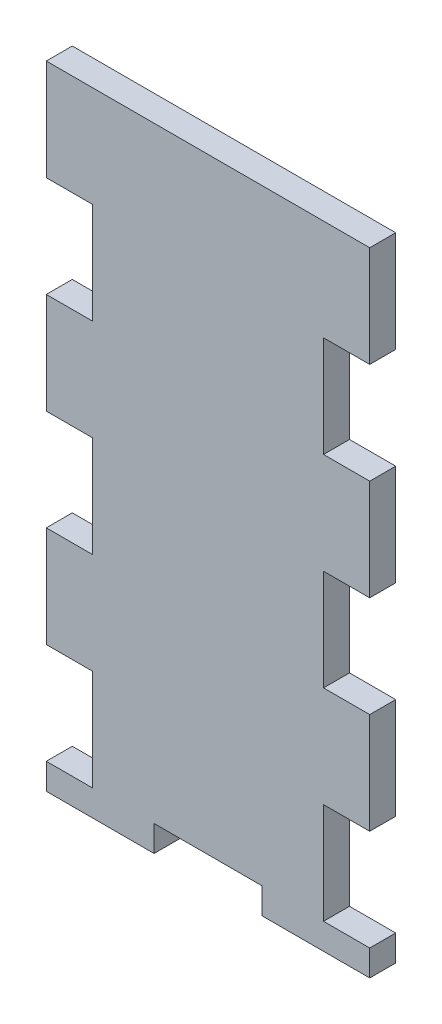
ISO-10303-21;
HEADER;
FILE_DESCRIPTION(('STEP AP214'),'2;1');
FILE_NAME('part.step','',(''),(''),'','','');
FILE_SCHEMA(('AUTOMOTIVE_DESIGN { 1 0 10303 214 1 1 1 1 }'));
ENDSEC;
DATA;
#1=APPLICATION_CONTEXT('core data for automotive mechanical design processes');
#2=APPLICATION_PROTOCOL_DEFINITION('international standard','automotive_design',2000,#1);
#3=PRODUCT_CONTEXT('',#1,'mechanical');
#4=PRODUCT('Part','Part','',(#3));
#5=PRODUCT_RELATED_PRODUCT_CATEGORY('part','',(#4));
#6=PRODUCT_DEFINITION_FORMATION('','',#4);
#7=PRODUCT_DEFINITION_CONTEXT('part definition',#1,'design');
#8=PRODUCT_DEFINITION('design','',#6,#7);
#9=PRODUCT_DEFINITION_SHAPE('','',#8);
#10=(LENGTH_UNIT() NAMED_UNIT(*) SI_UNIT(.MILLI.,.METRE.));
#11=(NAMED_UNIT(*) PLANE_ANGLE_UNIT() SI_UNIT($,.RADIAN.));
#12=(NAMED_UNIT(*) SI_UNIT($,.STERADIAN.) SOLID_ANGLE_UNIT());
#13=UNCERTAINTY_MEASURE_WITH_UNIT(LENGTH_MEASURE(1.E-05),#10,'distance_accuracy_value','');
#14=(GEOMETRIC_REPRESENTATION_CONTEXT(3) GLOBAL_UNCERTAINTY_ASSIGNED_CONTEXT((#13)) GLOBAL_UNIT_ASSIGNED_CONTEXT((#10,
#11,#12)) REPRESENTATION_CONTEXT('',''));
#15=CARTESIAN_POINT('',(0.,0.,0.));
#16=DIRECTION('',(0.,0.,1.));
#17=DIRECTION('',(1.,0.,0.));
#18=AXIS2_PLACEMENT_3D('',#15,#16,#17);
#19=CARTESIAN_POINT('',(-4.,-2.25,30.3402563178053));
#20=DIRECTION('',(0.,-1.,0.));
#21=DIRECTION('',(1.,0.,0.));
#22=AXIS2_PLACEMENT_3D('',#19,#20,#21);
#23=PLANE('',#22);
#24=DIRECTION('',(0.,0.,1.));
#25=VECTOR('',#24,1.);
#26=CARTESIAN_POINT('',(14.6666666666667,-2.25,0.));
#27=LINE('',#26,#25);
#28=CARTESIAN_POINT('',(14.6666666666667,-2.25,0.));
#29=VERTEX_POINT('',#28);
#30=CARTESIAN_POINT('',(14.6666666666667,-2.25,2.25));
#31=VERTEX_POINT('',#30);
#32=EDGE_CURVE('E476',#29,#31,#27,.T.);
#33=ORIENTED_EDGE('',*,*,#32,.F.);
#34=DIRECTION('',(-1.,0.,0.));
#35=VECTOR('',#34,1.);
#36=CARTESIAN_POINT('',(-4.,-2.25,0.));
#37=LINE('',#36,#35);
#38=CARTESIAN_POINT('',(24.,-2.25,0.));
#39=VERTEX_POINT('',#38);
#40=EDGE_CURVE('E1016',#39,#29,#37,.T.);
#41=ORIENTED_EDGE('',*,*,#40,.F.);
#42=DIRECTION('',(0.,0.,-1.));
#43=VECTOR('',#42,1.);
#44=CARTESIAN_POINT('',(24.,-2.25,30.3402563178053));
#45=LINE('',#44,#43);
#46=CARTESIAN_POINT('',(24.,-2.25,2.25));
#47=VERTEX_POINT('',#46);
#48=EDGE_CURVE('E486',#47,#39,#45,.T.);
#49=ORIENTED_EDGE('',*,*,#48,.F.);
#50=DIRECTION('',(-1.,0.,0.));
#51=VECTOR('',#50,1.);
#52=CARTESIAN_POINT('',(-4.,-2.25,2.25));
#53=LINE('',#52,#51);
#54=EDGE_CURVE('E485',#47,#31,#53,.T.);
#55=ORIENTED_EDGE('',*,*,#54,.T.);
#56=EDGE_LOOP('',(#33,#41,#49,#55));
#57=FACE_BOUND('',#56,.T.);
#58=ADVANCED_FACE('F39',(#57),#23,.T.);
#59=CARTESIAN_POINT('',(20.,0.,2.25));
#60=DIRECTION('',(-1.,0.,0.));
#61=DIRECTION('',(0.,0.,1.));
#62=AXIS2_PLACEMENT_3D('',#59,#60,#61);
#63=PLANE('',#62);
#64=DIRECTION('',(0.,1.,0.));
#65=VECTOR('',#64,1.);
#66=CARTESIAN_POINT('',(20.,0.,0.));
#67=LINE('',#66,#65);
#68=CARTESIAN_POINT('',(20.,0.,0.));
#69=VERTEX_POINT('',#68);
#70=CARTESIAN_POINT('',(20.,8.75000000000001,0.));
#71=VERTEX_POINT('',#70);
#72=EDGE_CURVE('E242',#69,#71,#67,.T.);
#73=ORIENTED_EDGE('',*,*,#72,.T.);
#74=DIRECTION('',(0.,0.,-1.));
#75=VECTOR('',#74,1.);
#76=CARTESIAN_POINT('',(20.,8.75000000000001,2.25));
#77=LINE('',#76,#75);
#78=CARTESIAN_POINT('',(20.,8.75000000000001,2.25));
#79=VERTEX_POINT('',#78);
#80=EDGE_CURVE('E47',#79,#71,#77,.T.);
#81=ORIENTED_EDGE('',*,*,#80,.F.);
#82=DIRECTION('',(0.,1.,0.));
#83=VECTOR('',#82,1.);
#84=CARTESIAN_POINT('',(20.,0.,2.25));
#85=LINE('',#84,#83);
#86=CARTESIAN_POINT('',(20.,0.,2.25));
#87=VERTEX_POINT('',#86);
#88=EDGE_CURVE('E147',#87,#79,#85,.T.);
#89=ORIENTED_EDGE('',*,*,#88,.F.);
#90=DIRECTION('',(0.,0.,-1.));
#91=VECTOR('',#90,1.);
#92=CARTESIAN_POINT('',(20.,0.,2.25));
#93=LINE('',#92,#91);
#94=EDGE_CURVE('E11',#87,#69,#93,.T.);
#95=ORIENTED_EDGE('',*,*,#94,.T.);
#96=EDGE_LOOP('',(#73,#81,#89,#95));
#97=FACE_BOUND('',#96,.T.);
#98=ADVANCED_FACE('F438',(#97),#63,.F.);
#99=CARTESIAN_POINT('',(-2.73218947466328E-13,8.74999999999939,2.25));
#100=DIRECTION('',(0.,1.,0.));
#101=DIRECTION('',(-1.,0.,0.));
#102=AXIS2_PLACEMENT_3D('',#99,#100,#101);
#103=PLANE('',#102);
#104=DIRECTION('',(1.,0.,0.));
#105=VECTOR('',#104,1.);
#106=CARTESIAN_POINT('',(-2.73218947466328E-13,8.74999999999939,0.));
#107=LINE('',#106,#105);
#108=CARTESIAN_POINT('',(24.,8.75000000000014,0.));
#109=VERTEX_POINT('',#108);
#110=EDGE_CURVE('E244',#71,#109,#107,.T.);
#111=ORIENTED_EDGE('',*,*,#110,.T.);
#112=DIRECTION('',(0.,0.,-1.));
#113=VECTOR('',#112,1.);
#114=CARTESIAN_POINT('',(24.,8.75000000000014,2.25));
#115=LINE('',#114,#113);
#116=CARTESIAN_POINT('',(24.,8.75000000000014,2.25));
#117=VERTEX_POINT('',#116);
#118=EDGE_CURVE('E339',#117,#109,#115,.T.);
#119=ORIENTED_EDGE('',*,*,#118,.F.);
#120=DIRECTION('',(1.,0.,0.));
#121=VECTOR('',#120,1.);
#122=CARTESIAN_POINT('',(-2.73218947466328E-13,8.74999999999939,2.25));
#123=LINE('',#122,#121);
#124=EDGE_CURVE('E345',#79,#117,#123,.T.);
#125=ORIENTED_EDGE('',*,*,#124,.F.);
#126=ORIENTED_EDGE('',*,*,#80,.T.);
#127=EDGE_LOOP('',(#111,#119,#125,#126));
#128=FACE_BOUND('',#127,.T.);
#129=ADVANCED_FACE('F41',(#128),#103,.F.);
#130=CARTESIAN_POINT('',(24.,0.,2.25));
#131=DIRECTION('',(1.,0.,0.));
#132=DIRECTION('',(0.,0.,-1.));
#133=AXIS2_PLACEMENT_3D('',#130,#131,#132);
#134=PLANE('',#133);
#135=DIRECTION('',(0.,-1.,0.));
#136=VECTOR('',#135,1.);
#137=CARTESIAN_POINT('',(24.,0.,0.));
#138=LINE('',#137,#136);
#139=CARTESIAN_POINT('',(24.,17.5,0.));
#140=VERTEX_POINT('',#139);
#141=EDGE_CURVE('E250',#140,#109,#138,.T.);
#142=ORIENTED_EDGE('',*,*,#141,.F.);
#143=DIRECTION('',(0.,0.,-1.));
#144=VECTOR('',#143,1.);
#145=CARTESIAN_POINT('',(24.,17.5,2.25));
#146=LINE('',#145,#144);
#147=CARTESIAN_POINT('',(24.,17.5,2.25));
#148=VERTEX_POINT('',#147);
#149=EDGE_CURVE('E337',#148,#140,#146,.T.);
#150=ORIENTED_EDGE('',*,*,#149,.F.);
#151=DIRECTION('',(0.,-1.,0.));
#152=VECTOR('',#151,1.);
#153=CARTESIAN_POINT('',(24.,0.,2.25));
#154=LINE('',#153,#152);
#155=EDGE_CURVE('E356',#148,#117,#154,.T.);
#156=ORIENTED_EDGE('',*,*,#155,.T.);
#157=ORIENTED_EDGE('',*,*,#118,.T.);
#158=EDGE_LOOP('',(#142,#150,#156,#157));
#159=FACE_BOUND('',#158,.T.);
#160=ADVANCED_FACE('F353',(#159),#134,.T.);
#161=CARTESIAN_POINT('',(0.,17.5000000000001,2.25));
#162=DIRECTION('',(0.,1.,0.));
#163=DIRECTION('',(-1.,0.,0.));
#164=AXIS2_PLACEMENT_3D('',#161,#162,#163);
#165=PLANE('',#164);
#166=DIRECTION('',(1.,0.,0.));
#167=VECTOR('',#166,1.);
#168=CARTESIAN_POINT('',(0.,17.5000000000001,0.));
#169=LINE('',#168,#167);
#170=CARTESIAN_POINT('',(20.,17.5,0.));
#171=VERTEX_POINT('',#170);
#172=EDGE_CURVE('E253',#171,#140,#169,.T.);
#173=ORIENTED_EDGE('',*,*,#172,.F.);
#174=DIRECTION('',(0.,0.,-1.));
#175=VECTOR('',#174,1.);
#176=CARTESIAN_POINT('',(20.,17.5,2.25));
#177=LINE('',#176,#175);
#178=CARTESIAN_POINT('',(20.,17.5,2.25));
#179=VERTEX_POINT('',#178);
#180=EDGE_CURVE('E335',#179,#171,#177,.T.);
#181=ORIENTED_EDGE('',*,*,#180,.F.);
#182=DIRECTION('',(1.,0.,0.));
#183=VECTOR('',#182,1.);
#184=CARTESIAN_POINT('',(0.,17.5000000000001,2.25));
#185=LINE('',#184,#183);
#186=EDGE_CURVE('E359',#179,#148,#185,.T.);
#187=ORIENTED_EDGE('',*,*,#186,.T.);
#188=ORIENTED_EDGE('',*,*,#149,.T.);
#189=EDGE_LOOP('',(#173,#181,#187,#188));
#190=FACE_BOUND('',#189,.T.);
#191=ADVANCED_FACE('F540',(#190),#165,.T.);
#192=CARTESIAN_POINT('',(20.,26.2500000000001,0.));
#193=VERTEX_POINT('',#192);
#194=EDGE_CURVE('E247',#171,#193,#67,.T.);
#195=ORIENTED_EDGE('',*,*,#194,.T.);
#196=DIRECTION('',(0.,0.,-1.));
#197=VECTOR('',#196,1.);
#198=CARTESIAN_POINT('',(20.,26.2500000000001,2.25));
#199=LINE('',#198,#197);
#200=CARTESIAN_POINT('',(20.,26.2500000000001,2.25));
#201=VERTEX_POINT('',#200);
#202=EDGE_CURVE('E332',#201,#193,#199,.T.);
#203=ORIENTED_EDGE('',*,*,#202,.F.);
#204=EDGE_CURVE('E361',#179,#201,#85,.T.);
#205=ORIENTED_EDGE('',*,*,#204,.F.);
#206=ORIENTED_EDGE('',*,*,#180,.T.);
#207=EDGE_LOOP('',(#195,#203,#205,#206));
#208=FACE_BOUND('',#207,.T.);
#209=ADVANCED_FACE('F446',(#208),#63,.F.);
#210=CARTESIAN_POINT('',(0.,26.2500000000001,2.25));
#211=DIRECTION('',(0.,1.,0.));
#212=DIRECTION('',(0.,0.,1.));
#213=AXIS2_PLACEMENT_3D('',#210,#211,#212);
#214=PLANE('',#213);
#215=DIRECTION('',(1.,0.,0.));
#216=VECTOR('',#215,1.);
#217=CARTESIAN_POINT('',(0.,26.2500000000001,0.));
#218=LINE('',#217,#216);
#219=CARTESIAN_POINT('',(24.,26.2500000000001,0.));
#220=VERTEX_POINT('',#219);
#221=EDGE_CURVE('E256',#193,#220,#218,.T.);
#222=ORIENTED_EDGE('',*,*,#221,.T.);
#223=DIRECTION('',(0.,0.,-1.));
#224=VECTOR('',#223,1.);
#225=CARTESIAN_POINT('',(24.,26.2500000000001,2.25));
#226=LINE('',#225,#224);
#227=CARTESIAN_POINT('',(24.,26.2500000000001,2.25));
#228=VERTEX_POINT('',#227);
#229=EDGE_CURVE('E330',#228,#220,#226,.T.);
#230=ORIENTED_EDGE('',*,*,#229,.F.);
#231=DIRECTION('',(1.,0.,0.));
#232=VECTOR('',#231,1.);
#233=CARTESIAN_POINT('',(0.,26.2500000000001,2.25));
#234=LINE('',#233,#232);
#235=EDGE_CURVE('E366',#201,#228,#234,.T.);
#236=ORIENTED_EDGE('',*,*,#235,.F.);
#237=ORIENTED_EDGE('',*,*,#202,.T.);
#238=EDGE_LOOP('',(#222,#230,#236,#237));
#239=FACE_BOUND('',#238,.T.);
#240=ADVANCED_FACE('F513',(#239),#214,.F.);
#241=CARTESIAN_POINT('',(24.,0.,2.25));
#242=DIRECTION('',(1.,0.,0.));
#243=DIRECTION('',(0.,0.,-1.));
#244=AXIS2_PLACEMENT_3D('',#241,#242,#243);
#245=PLANE('',#244);
#246=DIRECTION('',(0.,-1.,0.));
#247=VECTOR('',#246,1.);
#248=CARTESIAN_POINT('',(24.,0.,0.));
#249=LINE('',#248,#247);
#250=CARTESIAN_POINT('',(24.,35.,0.));
#251=VERTEX_POINT('',#250);
#252=EDGE_CURVE('E259',#251,#220,#249,.T.);
#253=ORIENTED_EDGE('',*,*,#252,.F.);
#254=DIRECTION('',(0.,0.,-1.));
#255=VECTOR('',#254,1.);
#256=CARTESIAN_POINT('',(24.,35.,2.25));
#257=LINE('',#256,#255);
#258=CARTESIAN_POINT('',(24.,35.,2.25));
#259=VERTEX_POINT('',#258);
#260=EDGE_CURVE('E328',#259,#251,#257,.T.);
#261=ORIENTED_EDGE('',*,*,#260,.F.);
#262=DIRECTION('',(0.,-1.,0.));
#263=VECTOR('',#262,1.);
#264=CARTESIAN_POINT('',(24.,0.,2.25));
#265=LINE('',#264,#263);
#266=EDGE_CURVE('E368',#259,#228,#265,.T.);
#267=ORIENTED_EDGE('',*,*,#266,.T.);
#268=ORIENTED_EDGE('',*,*,#229,.T.);
#269=EDGE_LOOP('',(#253,#261,#267,#268));
#270=FACE_BOUND('',#269,.T.);
#271=ADVANCED_FACE('F516',(#270),#245,.T.);
#272=CARTESIAN_POINT('',(3.64291929955066E-13,35.0000000000003,2.25));
#273=DIRECTION('',(0.,1.,0.));
#274=DIRECTION('',(-1.,0.,0.));
#275=AXIS2_PLACEMENT_3D('',#272,#273,#274);
#276=PLANE('',#275);
#277=DIRECTION('',(1.,0.,0.));
#278=VECTOR('',#277,1.);
#279=CARTESIAN_POINT('',(3.64291929955066E-13,35.0000000000003,0.));
#280=LINE('',#279,#278);
#281=CARTESIAN_POINT('',(20.,35.0000000000001,0.));
#282=VERTEX_POINT('',#281);
#283=EDGE_CURVE('E262',#282,#251,#280,.T.);
#284=ORIENTED_EDGE('',*,*,#283,.F.);
#285=DIRECTION('',(0.,0.,-1.));
#286=VECTOR('',#285,1.);
#287=CARTESIAN_POINT('',(20.,35.0000000000001,2.25));
#288=LINE('',#287,#286);
#289=CARTESIAN_POINT('',(20.,35.0000000000001,2.25));
#290=VERTEX_POINT('',#289);
#291=EDGE_CURVE('E326',#290,#282,#288,.T.);
#292=ORIENTED_EDGE('',*,*,#291,.F.);
#293=DIRECTION('',(1.,0.,0.));
#294=VECTOR('',#293,1.);
#295=CARTESIAN_POINT('',(3.64291929955066E-13,35.0000000000003,2.25));
#296=LINE('',#295,#294);
#297=EDGE_CURVE('E371',#290,#259,#296,.T.);
#298=ORIENTED_EDGE('',*,*,#297,.T.);
#299=ORIENTED_EDGE('',*,*,#260,.T.);
#300=EDGE_LOOP('',(#284,#292,#298,#299));
#301=FACE_BOUND('',#300,.T.);
#302=ADVANCED_FACE('F520',(#301),#276,.T.);
#303=CARTESIAN_POINT('',(20.,43.75,0.));
#304=VERTEX_POINT('',#303);
#305=EDGE_CURVE('E246',#282,#304,#67,.T.);
#306=ORIENTED_EDGE('',*,*,#305,.T.);
#307=DIRECTION('',(0.,0.,-1.));
#308=VECTOR('',#307,1.);
#309=CARTESIAN_POINT('',(20.,43.75,2.25));
#310=LINE('',#309,#308);
#311=CARTESIAN_POINT('',(20.,43.75,2.25));
#312=VERTEX_POINT('',#311);
#313=EDGE_CURVE('E323',#312,#304,#310,.T.);
#314=ORIENTED_EDGE('',*,*,#313,.F.);
#315=EDGE_CURVE('E374',#290,#312,#85,.T.);
#316=ORIENTED_EDGE('',*,*,#315,.F.);
#317=ORIENTED_EDGE('',*,*,#291,.T.);
#318=EDGE_LOOP('',(#306,#314,#316,#317));
#319=FACE_BOUND('',#318,.T.);
#320=ADVANCED_FACE('F447',(#319),#63,.F.);
#321=CARTESIAN_POINT('',(-4.5536491244391E-13,43.7499999999998,2.25));
#322=DIRECTION('',(0.,1.,0.));
#323=DIRECTION('',(-1.,0.,0.));
#324=AXIS2_PLACEMENT_3D('',#321,#322,#323);
#325=PLANE('',#324);
#326=DIRECTION('',(1.,0.,0.));
#327=VECTOR('',#326,1.);
#328=CARTESIAN_POINT('',(-4.5536491244391E-13,43.7499999999998,0.));
#329=LINE('',#328,#327);
#330=CARTESIAN_POINT('',(24.,43.75,0.));
#331=VERTEX_POINT('',#330);
#332=EDGE_CURVE('E265',#304,#331,#329,.T.);
#333=ORIENTED_EDGE('',*,*,#332,.T.);
#334=DIRECTION('',(0.,0.,-1.));
#335=VECTOR('',#334,1.);
#336=CARTESIAN_POINT('',(24.,43.75,2.25));
#337=LINE('',#336,#335);
#338=CARTESIAN_POINT('',(24.,43.75,2.25));
#339=VERTEX_POINT('',#338);
#340=EDGE_CURVE('E321',#339,#331,#337,.T.);
#341=ORIENTED_EDGE('',*,*,#340,.F.);
#342=DIRECTION('',(1.,0.,0.));
#343=VECTOR('',#342,1.);
#344=CARTESIAN_POINT('',(-4.5536491244391E-13,43.7499999999998,2.25));
#345=LINE('',#344,#343);
#346=EDGE_CURVE('E375',#312,#339,#345,.T.);
#347=ORIENTED_EDGE('',*,*,#346,.F.);
#348=ORIENTED_EDGE('',*,*,#313,.T.);
#349=EDGE_LOOP('',(#333,#341,#347,#348));
#350=FACE_BOUND('',#349,.T.);
#351=ADVANCED_FACE('F529',(#350),#325,.F.);
#352=CARTESIAN_POINT('',(24.,0.,2.25));
#353=DIRECTION('',(1.,0.,0.));
#354=DIRECTION('',(0.,0.,-1.));
#355=AXIS2_PLACEMENT_3D('',#352,#353,#354);
#356=PLANE('',#355);
#357=DIRECTION('',(0.,-1.,0.));
#358=VECTOR('',#357,1.);
#359=CARTESIAN_POINT('',(24.,0.,0.));
#360=LINE('',#359,#358);
#361=CARTESIAN_POINT('',(24.,52.5,0.));
#362=VERTEX_POINT('',#361);
#363=EDGE_CURVE('E268',#362,#331,#360,.T.);
#364=ORIENTED_EDGE('',*,*,#363,.F.);
#365=DIRECTION('',(0.,0.,-1.));
#366=VECTOR('',#365,1.);
#367=CARTESIAN_POINT('',(24.,52.5,2.25));
#368=LINE('',#367,#366);
#369=CARTESIAN_POINT('',(24.,52.5,2.25));
#370=VERTEX_POINT('',#369);
#371=EDGE_CURVE('E318',#370,#362,#368,.T.);
#372=ORIENTED_EDGE('',*,*,#371,.F.);
#373=DIRECTION('',(0.,-1.,0.));
#374=VECTOR('',#373,1.);
#375=CARTESIAN_POINT('',(24.,0.,2.25));
#376=LINE('',#375,#374);
#377=EDGE_CURVE('E377',#370,#339,#376,.T.);
#378=ORIENTED_EDGE('',*,*,#377,.T.);
#379=ORIENTED_EDGE('',*,*,#340,.T.);
#380=EDGE_LOOP('',(#364,#372,#378,#379));
#381=FACE_BOUND('',#380,.T.);
#382=ADVANCED_FACE('F533',(#381),#356,.T.);
#383=CARTESIAN_POINT('',(1.3660947373318E-12,52.4999999999999,2.25));
#384=DIRECTION('',(0.,-1.,0.));
#385=DIRECTION('',(1.,0.,0.));
#386=AXIS2_PLACEMENT_3D('',#383,#384,#385);
#387=PLANE('',#386);
#388=DIRECTION('',(-1.,0.,0.));
#389=VECTOR('',#388,1.);
#390=CARTESIAN_POINT('',(1.3660947373318E-12,52.4999999999999,0.));
#391=LINE('',#390,#389);
#392=CARTESIAN_POINT('',(-4.,52.5,0.));
#393=VERTEX_POINT('',#392);
#394=EDGE_CURVE('E271',#362,#393,#391,.T.);
#395=ORIENTED_EDGE('',*,*,#394,.T.);
#396=DIRECTION('',(0.,0.,-1.));
#397=VECTOR('',#396,1.);
#398=CARTESIAN_POINT('',(-4.,52.5,2.25));
#399=LINE('',#398,#397);
#400=CARTESIAN_POINT('',(-4.,52.5,2.25));
#401=VERTEX_POINT('',#400);
#402=EDGE_CURVE('E315',#401,#393,#399,.T.);
#403=ORIENTED_EDGE('',*,*,#402,.F.);
#404=DIRECTION('',(1.,0.,0.));
#405=VECTOR('',#404,1.);
#406=CARTESIAN_POINT('',(0.,52.5,2.25));
#407=LINE('',#406,#405);
#408=EDGE_CURVE('E380',#401,#370,#407,.T.);
#409=ORIENTED_EDGE('',*,*,#408,.T.);
#410=ORIENTED_EDGE('',*,*,#371,.T.);
#411=EDGE_LOOP('',(#395,#403,#409,#410));
#412=FACE_BOUND('',#411,.T.);
#413=ADVANCED_FACE('F535',(#412),#387,.F.);
#414=CARTESIAN_POINT('',(-4.,0.,2.25));
#415=DIRECTION('',(1.,0.,0.));
#416=DIRECTION('',(0.,0.,-1.));
#417=AXIS2_PLACEMENT_3D('',#414,#415,#416);
#418=PLANE('',#417);
#419=DIRECTION('',(0.,-1.,0.));
#420=VECTOR('',#419,1.);
#421=CARTESIAN_POINT('',(-4.,0.,0.));
#422=LINE('',#421,#420);
#423=CARTESIAN_POINT('',(-4.,43.75,0.));
#424=VERTEX_POINT('',#423);
#425=EDGE_CURVE('E279',#393,#424,#422,.T.);
#426=ORIENTED_EDGE('',*,*,#425,.T.);
#427=DIRECTION('',(0.,0.,-1.));
#428=VECTOR('',#427,1.);
#429=CARTESIAN_POINT('',(-4.,43.75,2.25));
#430=LINE('',#429,#428);
#431=CARTESIAN_POINT('',(-4.,43.75,2.25));
#432=VERTEX_POINT('',#431);
#433=EDGE_CURVE('E313',#432,#424,#430,.T.);
#434=ORIENTED_EDGE('',*,*,#433,.F.);
#435=DIRECTION('',(0.,-1.,0.));
#436=VECTOR('',#435,1.);
#437=CARTESIAN_POINT('',(-4.,0.,2.25));
#438=LINE('',#437,#436);
#439=EDGE_CURVE('E382',#401,#432,#438,.T.);
#440=ORIENTED_EDGE('',*,*,#439,.F.);
#441=ORIENTED_EDGE('',*,*,#402,.T.);
#442=EDGE_LOOP('',(#426,#434,#440,#441));
#443=FACE_BOUND('',#442,.T.);
#444=ADVANCED_FACE('F538',(#443),#418,.F.);
#445=CARTESIAN_POINT('',(1.13841228110978E-12,43.75,2.25));
#446=DIRECTION('',(0.,-1.,0.));
#447=DIRECTION('',(1.,0.,0.));
#448=AXIS2_PLACEMENT_3D('',#445,#446,#447);
#449=PLANE('',#448);
#450=DIRECTION('',(-1.,0.,0.));
#451=VECTOR('',#450,1.);
#452=CARTESIAN_POINT('',(1.13841228110978E-12,43.75,0.));
#453=LINE('',#452,#451);
#454=CARTESIAN_POINT('',(0.,43.75,0.));
#455=VERTEX_POINT('',#454);
#456=EDGE_CURVE('E282',#455,#424,#453,.T.);
#457=ORIENTED_EDGE('',*,*,#456,.F.);
#458=DIRECTION('',(0.,0.,-1.));
#459=VECTOR('',#458,1.);
#460=CARTESIAN_POINT('',(0.,43.75,2.25));
#461=LINE('',#460,#459);
#462=CARTESIAN_POINT('',(0.,43.75,2.25));
#463=VERTEX_POINT('',#462);
#464=EDGE_CURVE('E311',#463,#455,#461,.T.);
#465=ORIENTED_EDGE('',*,*,#464,.F.);
#466=DIRECTION('',(-1.,0.,0.));
#467=VECTOR('',#466,1.);
#468=CARTESIAN_POINT('',(1.13841228110978E-12,43.75,2.25));
#469=LINE('',#468,#467);
#470=EDGE_CURVE('E385',#463,#432,#469,.T.);
#471=ORIENTED_EDGE('',*,*,#470,.T.);
#472=ORIENTED_EDGE('',*,*,#433,.T.);
#473=EDGE_LOOP('',(#457,#465,#471,#472));
#474=FACE_BOUND('',#473,.T.);
#475=ADVANCED_FACE('F408',(#474),#449,.T.);
#476=CARTESIAN_POINT('',(0.,0.,2.25));
#477=DIRECTION('',(-1.,0.,0.));
#478=DIRECTION('',(0.,0.,1.));
#479=AXIS2_PLACEMENT_3D('',#476,#477,#478);
#480=PLANE('',#479);
#481=DIRECTION('',(0.,1.,0.));
#482=VECTOR('',#481,1.);
#483=CARTESIAN_POINT('',(0.,0.,0.));
#484=LINE('',#483,#482);
#485=CARTESIAN_POINT('',(0.,34.9999999999999,0.));
#486=VERTEX_POINT('',#485);
#487=EDGE_CURVE('E277',#486,#455,#484,.T.);
#488=ORIENTED_EDGE('',*,*,#487,.F.);
#489=DIRECTION('',(0.,0.,-1.));
#490=VECTOR('',#489,1.);
#491=CARTESIAN_POINT('',(0.,34.9999999999999,2.25));
#492=LINE('',#491,#490);
#493=CARTESIAN_POINT('',(0.,34.9999999999999,2.25));
#494=VERTEX_POINT('',#493);
#495=EDGE_CURVE('E309',#494,#486,#492,.T.);
#496=ORIENTED_EDGE('',*,*,#495,.F.);
#497=DIRECTION('',(0.,1.,0.));
#498=VECTOR('',#497,1.);
#499=CARTESIAN_POINT('',(0.,0.,2.25));
#500=LINE('',#499,#498);
#501=EDGE_CURVE('E239',#494,#463,#500,.T.);
#502=ORIENTED_EDGE('',*,*,#501,.T.);
#503=ORIENTED_EDGE('',*,*,#464,.T.);
#504=EDGE_LOOP('',(#488,#496,#502,#503));
#505=FACE_BOUND('',#504,.T.);
#506=ADVANCED_FACE('F400',(#505),#480,.T.);
#507=CARTESIAN_POINT('',(1.45716771982051E-12,34.9999999999999,2.25));
#508=DIRECTION('',(0.,-1.,0.));
#509=DIRECTION('',(1.,0.,0.));
#510=AXIS2_PLACEMENT_3D('',#507,#508,#509);
#511=PLANE('',#510);
#512=DIRECTION('',(-1.,0.,0.));
#513=VECTOR('',#512,1.);
#514=CARTESIAN_POINT('',(1.45716771982051E-12,34.9999999999999,0.));
#515=LINE('',#514,#513);
#516=CARTESIAN_POINT('',(-4.,35.,0.));
#517=VERTEX_POINT('',#516);
#518=EDGE_CURVE('E285',#486,#517,#515,.T.);
#519=ORIENTED_EDGE('',*,*,#518,.T.);
#520=DIRECTION('',(0.,0.,-1.));
#521=VECTOR('',#520,1.);
#522=CARTESIAN_POINT('',(-4.,35.,2.25));
#523=LINE('',#522,#521);
#524=CARTESIAN_POINT('',(-4.,35.,2.25));
#525=VERTEX_POINT('',#524);
#526=EDGE_CURVE('E306',#525,#517,#523,.T.);
#527=ORIENTED_EDGE('',*,*,#526,.F.);
#528=DIRECTION('',(-1.,0.,0.));
#529=VECTOR('',#528,1.);
#530=CARTESIAN_POINT('',(1.45716771982051E-12,34.9999999999999,2.25));
#531=LINE('',#530,#529);
#532=EDGE_CURVE('E388',#494,#525,#531,.T.);
#533=ORIENTED_EDGE('',*,*,#532,.F.);
#534=ORIENTED_EDGE('',*,*,#495,.T.);
#535=EDGE_LOOP('',(#519,#527,#533,#534));
#536=FACE_BOUND('',#535,.T.);
#537=ADVANCED_FACE('F426',(#536),#511,.F.);
#538=CARTESIAN_POINT('',(-4.,0.,2.25));
#539=DIRECTION('',(1.,0.,0.));
#540=DIRECTION('',(0.,0.,-1.));
#541=AXIS2_PLACEMENT_3D('',#538,#539,#540);
#542=PLANE('',#541);
#543=DIRECTION('',(0.,-1.,0.));
#544=VECTOR('',#543,1.);
#545=CARTESIAN_POINT('',(-4.,0.,0.));
#546=LINE('',#545,#544);
#547=CARTESIAN_POINT('',(-4.,26.2500000000001,0.));
#548=VERTEX_POINT('',#547);
#549=EDGE_CURVE('E287',#517,#548,#546,.T.);
#550=ORIENTED_EDGE('',*,*,#549,.T.);
#551=DIRECTION('',(0.,0.,-1.));
#552=VECTOR('',#551,1.);
#553=CARTESIAN_POINT('',(-4.,26.2500000000001,2.25));
#554=LINE('',#553,#552);
#555=CARTESIAN_POINT('',(-4.,26.2500000000001,2.25));
#556=VERTEX_POINT('',#555);
#557=EDGE_CURVE('E304',#556,#548,#554,.T.);
#558=ORIENTED_EDGE('',*,*,#557,.F.);
#559=DIRECTION('',(0.,-1.,0.));
#560=VECTOR('',#559,1.);
#561=CARTESIAN_POINT('',(-4.,0.,2.25));
#562=LINE('',#561,#560);
#563=EDGE_CURVE('E390',#525,#556,#562,.T.);
#564=ORIENTED_EDGE('',*,*,#563,.F.);
#565=ORIENTED_EDGE('',*,*,#526,.T.);
#566=EDGE_LOOP('',(#550,#558,#564,#565));
#567=FACE_BOUND('',#566,.T.);
#568=ADVANCED_FACE('F424',(#567),#542,.F.);
#569=CARTESIAN_POINT('',(1.36609473733167E-12,26.2499999999999,2.25));
#570=DIRECTION('',(0.,-1.,0.));
#571=DIRECTION('',(1.,0.,0.));
#572=AXIS2_PLACEMENT_3D('',#569,#570,#571);
#573=PLANE('',#572);
#574=DIRECTION('',(-1.,0.,0.));
#575=VECTOR('',#574,1.);
#576=CARTESIAN_POINT('',(1.36609473733167E-12,26.2499999999999,0.));
#577=LINE('',#576,#575);
#578=CARTESIAN_POINT('',(0.,26.25,0.));
#579=VERTEX_POINT('',#578);
#580=EDGE_CURVE('E290',#579,#548,#577,.T.);
#581=ORIENTED_EDGE('',*,*,#580,.F.);
#582=DIRECTION('',(0.,0.,-1.));
#583=VECTOR('',#582,1.);
#584=CARTESIAN_POINT('',(0.,26.25,2.25));
#585=LINE('',#584,#583);
#586=CARTESIAN_POINT('',(0.,26.25,2.25));
#587=VERTEX_POINT('',#586);
#588=EDGE_CURVE('E302',#587,#579,#585,.T.);
#589=ORIENTED_EDGE('',*,*,#588,.F.);
#590=DIRECTION('',(-1.,0.,0.));
#591=VECTOR('',#590,1.);
#592=CARTESIAN_POINT('',(1.36609473733167E-12,26.2499999999999,2.25));
#593=LINE('',#592,#591);
#594=EDGE_CURVE('E392',#587,#556,#593,.T.);
#595=ORIENTED_EDGE('',*,*,#594,.T.);
#596=ORIENTED_EDGE('',*,*,#557,.T.);
#597=EDGE_LOOP('',(#581,#589,#595,#596));
#598=FACE_BOUND('',#597,.T.);
#599=ADVANCED_FACE('F420',(#598),#573,.T.);
#600=CARTESIAN_POINT('',(0.,17.4999999999998,0.));
#601=VERTEX_POINT('',#600);
#602=EDGE_CURVE('E276',#601,#579,#484,.T.);
#603=ORIENTED_EDGE('',*,*,#602,.F.);
#604=DIRECTION('',(0.,0.,-1.));
#605=VECTOR('',#604,1.);
#606=CARTESIAN_POINT('',(0.,17.4999999999998,2.25));
#607=LINE('',#606,#605);
#608=CARTESIAN_POINT('',(0.,17.4999999999998,2.25));
#609=VERTEX_POINT('',#608);
#610=EDGE_CURVE('E300',#609,#601,#607,.T.);
#611=ORIENTED_EDGE('',*,*,#610,.F.);
#612=EDGE_CURVE('E238',#609,#587,#500,.T.);
#613=ORIENTED_EDGE('',*,*,#612,.T.);
#614=ORIENTED_EDGE('',*,*,#588,.T.);
#615=EDGE_LOOP('',(#603,#611,#613,#614));
#616=FACE_BOUND('',#615,.T.);
#617=ADVANCED_FACE('F417',(#616),#480,.T.);
#618=CARTESIAN_POINT('',(8.34835672813792E-13,17.4999999999998,2.25));
#619=DIRECTION('',(0.,-1.,0.));
#620=DIRECTION('',(1.,0.,0.));
#621=AXIS2_PLACEMENT_3D('',#618,#619,#620);
#622=PLANE('',#621);
#623=DIRECTION('',(-1.,0.,0.));
#624=VECTOR('',#623,1.);
#625=CARTESIAN_POINT('',(8.34835672813792E-13,17.4999999999998,0.));
#626=LINE('',#625,#624);
#627=CARTESIAN_POINT('',(-4.,17.5,0.));
#628=VERTEX_POINT('',#627);
#629=EDGE_CURVE('E293',#601,#628,#626,.T.);
#630=ORIENTED_EDGE('',*,*,#629,.T.);
#631=DIRECTION('',(0.,0.,-1.));
#632=VECTOR('',#631,1.);
#633=CARTESIAN_POINT('',(-4.,17.5,2.25));
#634=LINE('',#633,#632);
#635=CARTESIAN_POINT('',(-4.,17.5,2.25));
#636=VERTEX_POINT('',#635);
#637=EDGE_CURVE('E232',#636,#628,#634,.T.);
#638=ORIENTED_EDGE('',*,*,#637,.F.);
#639=DIRECTION('',(-1.,0.,0.));
#640=VECTOR('',#639,1.);
#641=CARTESIAN_POINT('',(8.34835672813792E-13,17.4999999999998,2.25));
#642=LINE('',#641,#640);
#643=EDGE_CURVE('E220',#609,#636,#642,.T.);
#644=ORIENTED_EDGE('',*,*,#643,.F.);
#645=ORIENTED_EDGE('',*,*,#610,.T.);
#646=EDGE_LOOP('',(#630,#638,#644,#645));
#647=FACE_BOUND('',#646,.T.);
#648=ADVANCED_FACE('F602',(#647),#622,.F.);
#649=CARTESIAN_POINT('',(-4.,0.,2.25));
#650=DIRECTION('',(1.,0.,0.));
#651=DIRECTION('',(0.,0.,-1.));
#652=AXIS2_PLACEMENT_3D('',#649,#650,#651);
#653=PLANE('',#652);
#654=DIRECTION('',(0.,-1.,0.));
#655=VECTOR('',#654,1.);
#656=CARTESIAN_POINT('',(-4.,0.,0.));
#657=LINE('',#656,#655);
#658=CARTESIAN_POINT('',(-4.,8.75000000000014,0.));
#659=VERTEX_POINT('',#658);
#660=EDGE_CURVE('E229',#628,#659,#657,.T.);
#661=ORIENTED_EDGE('',*,*,#660,.T.);
#662=DIRECTION('',(0.,0.,-1.));
#663=VECTOR('',#662,1.);
#664=CARTESIAN_POINT('',(-4.,8.75000000000014,2.25));
#665=LINE('',#664,#663);
#666=CARTESIAN_POINT('',(-4.,8.75000000000014,2.25));
#667=VERTEX_POINT('',#666);
#668=EDGE_CURVE('E226',#667,#659,#665,.T.);
#669=ORIENTED_EDGE('',*,*,#668,.F.);
#670=DIRECTION('',(0.,-1.,0.));
#671=VECTOR('',#670,1.);
#672=CARTESIAN_POINT('',(-4.,0.,2.25));
#673=LINE('',#672,#671);
#674=EDGE_CURVE('E213',#636,#667,#673,.T.);
#675=ORIENTED_EDGE('',*,*,#674,.F.);
#676=ORIENTED_EDGE('',*,*,#637,.T.);
#677=EDGE_LOOP('',(#661,#669,#675,#676));
#678=FACE_BOUND('',#677,.T.);
#679=ADVANCED_FACE('F227',(#678),#653,.F.);
#680=CARTESIAN_POINT('',(2.73218947466348E-13,8.75000000000001,2.25));
#681=DIRECTION('',(0.,-1.,0.));
#682=DIRECTION('',(1.,0.,0.));
#683=AXIS2_PLACEMENT_3D('',#680,#681,#682);
#684=PLANE('',#683);
#685=DIRECTION('',(-1.,0.,0.));
#686=VECTOR('',#685,1.);
#687=CARTESIAN_POINT('',(2.73218947466348E-13,8.75000000000001,0.));
#688=LINE('',#687,#686);
#689=CARTESIAN_POINT('',(0.,8.75000000000008,0.));
#690=VERTEX_POINT('',#689);
#691=EDGE_CURVE('E275',#690,#659,#688,.T.);
#692=ORIENTED_EDGE('',*,*,#691,.F.);
#693=DIRECTION('',(0.,0.,-1.));
#694=VECTOR('',#693,1.);
#695=CARTESIAN_POINT('',(0.,8.75000000000008,2.25));
#696=LINE('',#695,#694);
#697=CARTESIAN_POINT('',(0.,8.75000000000008,2.25));
#698=VERTEX_POINT('',#697);
#699=EDGE_CURVE('E139',#698,#690,#696,.T.);
#700=ORIENTED_EDGE('',*,*,#699,.F.);
#701=DIRECTION('',(-1.,0.,0.));
#702=VECTOR('',#701,1.);
#703=CARTESIAN_POINT('',(2.73218947466348E-13,8.75000000000001,2.25));
#704=LINE('',#703,#702);
#705=EDGE_CURVE('E217',#698,#667,#704,.T.);
#706=ORIENTED_EDGE('',*,*,#705,.T.);
#707=ORIENTED_EDGE('',*,*,#668,.T.);
#708=EDGE_LOOP('',(#692,#700,#706,#707));
#709=FACE_BOUND('',#708,.T.);
#710=ADVANCED_FACE('F234',(#709),#684,.T.);
#711=CARTESIAN_POINT('',(0.,0.,0.));
#712=VERTEX_POINT('',#711);
#713=EDGE_CURVE('E272',#712,#690,#484,.T.);
#714=ORIENTED_EDGE('',*,*,#713,.F.);
#715=DIRECTION('',(0.,0.,-1.));
#716=VECTOR('',#715,1.);
#717=CARTESIAN_POINT('',(0.,0.,2.25));
#718=LINE('',#717,#716);
#719=CARTESIAN_POINT('',(0.,0.,2.25));
#720=VERTEX_POINT('',#719);
#721=EDGE_CURVE('E63',#720,#712,#718,.T.);
#722=ORIENTED_EDGE('',*,*,#721,.F.);
#723=EDGE_CURVE('E235',#720,#698,#500,.T.);
#724=ORIENTED_EDGE('',*,*,#723,.T.);
#725=ORIENTED_EDGE('',*,*,#699,.T.);
#726=EDGE_LOOP('',(#714,#722,#724,#725));
#727=FACE_BOUND('',#726,.T.);
#728=ADVANCED_FACE('F435',(#727),#480,.T.);
#729=CARTESIAN_POINT('',(0.,0.,2.25));
#730=DIRECTION('',(0.,0.,1.));
#731=DIRECTION('',(1.,0.,0.));
#732=AXIS2_PLACEMENT_3D('',#729,#730,#731);
#733=PLANE('',#732);
#734=ORIENTED_EDGE('',*,*,#408,.F.);
#735=ORIENTED_EDGE('',*,*,#439,.T.);
#736=ORIENTED_EDGE('',*,*,#470,.F.);
#737=ORIENTED_EDGE('',*,*,#501,.F.);
#738=ORIENTED_EDGE('',*,*,#532,.T.);
#739=ORIENTED_EDGE('',*,*,#563,.T.);
#740=ORIENTED_EDGE('',*,*,#594,.F.);
#741=ORIENTED_EDGE('',*,*,#612,.F.);
#742=ORIENTED_EDGE('',*,*,#643,.T.);
#743=ORIENTED_EDGE('',*,*,#674,.T.);
#744=ORIENTED_EDGE('',*,*,#705,.F.);
#745=ORIENTED_EDGE('',*,*,#723,.F.);
#746=DIRECTION('',(1.,0.,0.));
#747=VECTOR('',#746,1.);
#748=CARTESIAN_POINT('',(-4.,0.,2.25));
#749=LINE('',#748,#747);
#750=CARTESIAN_POINT('',(-4.,0.,2.25));
#751=VERTEX_POINT('',#750);
#752=EDGE_CURVE('E502',#751,#720,#749,.T.);
#753=ORIENTED_EDGE('',*,*,#752,.F.);
#754=DIRECTION('',(0.,1.,0.));
#755=VECTOR('',#754,1.);
#756=CARTESIAN_POINT('',(-4.,0.,2.25));
#757=LINE('',#756,#755);
#758=CARTESIAN_POINT('',(-4.,-2.25,2.25));
#759=VERTEX_POINT('',#758);
#760=EDGE_CURVE('E483',#759,#751,#757,.T.);
#761=ORIENTED_EDGE('',*,*,#760,.F.);
#762=CARTESIAN_POINT('',(5.33333333333333,-2.25,2.25));
#763=VERTEX_POINT('',#762);
#764=EDGE_CURVE('E469',#763,#759,#53,.T.);
#765=ORIENTED_EDGE('',*,*,#764,.F.);
#766=DIRECTION('',(0.,-1.,0.));
#767=VECTOR('',#766,1.);
#768=CARTESIAN_POINT('',(5.33333333333333,-2.25,2.25));
#769=LINE('',#768,#767);
#770=CARTESIAN_POINT('',(5.33333333333333,0.,2.25));
#771=VERTEX_POINT('',#770);
#772=EDGE_CURVE('E54',#771,#763,#769,.T.);
#773=ORIENTED_EDGE('',*,*,#772,.F.);
#774=DIRECTION('',(-1.,0.,0.));
#775=VECTOR('',#774,1.);
#776=CARTESIAN_POINT('',(14.6666666666667,0.,2.25));
#777=LINE('',#776,#775);
#778=CARTESIAN_POINT('',(14.6666666666667,0.,2.25));
#779=VERTEX_POINT('',#778);
#780=EDGE_CURVE('E993',#779,#771,#777,.T.);
#781=ORIENTED_EDGE('',*,*,#780,.F.);
#782=DIRECTION('',(0.,1.,0.));
#783=VECTOR('',#782,1.);
#784=CARTESIAN_POINT('',(14.6666666666667,-2.25,2.25));
#785=LINE('',#784,#783);
#786=EDGE_CURVE('E1003',#31,#779,#785,.T.);
#787=ORIENTED_EDGE('',*,*,#786,.F.);
#788=ORIENTED_EDGE('',*,*,#54,.F.);
#789=DIRECTION('',(0.,-1.,0.));
#790=VECTOR('',#789,1.);
#791=CARTESIAN_POINT('',(24.,0.,2.25));
#792=LINE('',#791,#790);
#793=CARTESIAN_POINT('',(24.,0.,2.25));
#794=VERTEX_POINT('',#793);
#795=EDGE_CURVE('E491',#794,#47,#792,.T.);
#796=ORIENTED_EDGE('',*,*,#795,.F.);
#797=EDGE_CURVE('E1019',#87,#794,#749,.T.);
#798=ORIENTED_EDGE('',*,*,#797,.F.);
#799=ORIENTED_EDGE('',*,*,#88,.T.);
#800=ORIENTED_EDGE('',*,*,#124,.T.);
#801=ORIENTED_EDGE('',*,*,#155,.F.);
#802=ORIENTED_EDGE('',*,*,#186,.F.);
#803=ORIENTED_EDGE('',*,*,#204,.T.);
#804=ORIENTED_EDGE('',*,*,#235,.T.);
#805=ORIENTED_EDGE('',*,*,#266,.F.);
#806=ORIENTED_EDGE('',*,*,#297,.F.);
#807=ORIENTED_EDGE('',*,*,#315,.T.);
#808=ORIENTED_EDGE('',*,*,#346,.T.);
#809=ORIENTED_EDGE('',*,*,#377,.F.);
#810=EDGE_LOOP('',(#734,#735,#736,#737,#738,#739,#740,#741,#742,#743,#744,#745,#753,#761,#765,
#773,#781,#787,#788,#796,#798,#799,#800,#801,#802,#803,#804,#805,#806,#807,#808,#809));
#811=FACE_BOUND('',#810,.T.);
#812=ADVANCED_FACE('F215',(#811),#733,.T.);
#813=CARTESIAN_POINT('',(0.,0.,0.));
#814=DIRECTION('',(0.,0.,1.));
#815=DIRECTION('',(1.,0.,0.));
#816=AXIS2_PLACEMENT_3D('',#813,#814,#815);
#817=PLANE('',#816);
#818=ORIENTED_EDGE('',*,*,#394,.F.);
#819=ORIENTED_EDGE('',*,*,#363,.T.);
#820=ORIENTED_EDGE('',*,*,#332,.F.);
#821=ORIENTED_EDGE('',*,*,#305,.F.);
#822=ORIENTED_EDGE('',*,*,#283,.T.);
#823=ORIENTED_EDGE('',*,*,#252,.T.);
#824=ORIENTED_EDGE('',*,*,#221,.F.);
#825=ORIENTED_EDGE('',*,*,#194,.F.);
#826=ORIENTED_EDGE('',*,*,#172,.T.);
#827=ORIENTED_EDGE('',*,*,#141,.T.);
#828=ORIENTED_EDGE('',*,*,#110,.F.);
#829=ORIENTED_EDGE('',*,*,#72,.F.);
#830=DIRECTION('',(1.,0.,0.));
#831=VECTOR('',#830,1.);
#832=CARTESIAN_POINT('',(-4.,0.,0.));
#833=LINE('',#832,#831);
#834=CARTESIAN_POINT('',(24.,0.,0.));
#835=VERTEX_POINT('',#834);
#836=EDGE_CURVE('E1026',#69,#835,#833,.T.);
#837=ORIENTED_EDGE('',*,*,#836,.T.);
#838=DIRECTION('',(0.,-1.,0.));
#839=VECTOR('',#838,1.);
#840=CARTESIAN_POINT('',(24.,0.,0.));
#841=LINE('',#840,#839);
#842=EDGE_CURVE('E1020',#835,#39,#841,.T.);
#843=ORIENTED_EDGE('',*,*,#842,.T.);
#844=ORIENTED_EDGE('',*,*,#40,.T.);
#845=DIRECTION('',(0.,1.,0.));
#846=VECTOR('',#845,1.);
#847=CARTESIAN_POINT('',(14.6666666666667,-2.25,0.));
#848=LINE('',#847,#846);
#849=CARTESIAN_POINT('',(14.6666666666667,0.,0.));
#850=VERTEX_POINT('',#849);
#851=EDGE_CURVE('E1005',#29,#850,#848,.T.);
#852=ORIENTED_EDGE('',*,*,#851,.T.);
#853=DIRECTION('',(-1.,0.,0.));
#854=VECTOR('',#853,1.);
#855=CARTESIAN_POINT('',(14.6666666666667,0.,0.));
#856=LINE('',#855,#854);
#857=CARTESIAN_POINT('',(5.33333333333333,0.,0.));
#858=VERTEX_POINT('',#857);
#859=EDGE_CURVE('E1063',#850,#858,#856,.T.);
#860=ORIENTED_EDGE('',*,*,#859,.T.);
#861=DIRECTION('',(0.,-1.,0.));
#862=VECTOR('',#861,1.);
#863=CARTESIAN_POINT('',(5.33333333333333,-2.25,0.));
#864=LINE('',#863,#862);
#865=CARTESIAN_POINT('',(5.33333333333333,-2.25,0.));
#866=VERTEX_POINT('',#865);
#867=EDGE_CURVE('E1015',#858,#866,#864,.T.);
#868=ORIENTED_EDGE('',*,*,#867,.T.);
#869=CARTESIAN_POINT('',(-4.,-2.25,0.));
#870=VERTEX_POINT('',#869);
#871=EDGE_CURVE('E473',#866,#870,#37,.T.);
#872=ORIENTED_EDGE('',*,*,#871,.T.);
#873=DIRECTION('',(0.,1.,0.));
#874=VECTOR('',#873,1.);
#875=CARTESIAN_POINT('',(-4.,0.,0.));
#876=LINE('',#875,#874);
#877=CARTESIAN_POINT('',(-4.,0.,0.));
#878=VERTEX_POINT('',#877);
#879=EDGE_CURVE('E1011',#870,#878,#876,.T.);
#880=ORIENTED_EDGE('',*,*,#879,.T.);
#881=EDGE_CURVE('E1023',#878,#712,#833,.T.);
#882=ORIENTED_EDGE('',*,*,#881,.T.);
#883=ORIENTED_EDGE('',*,*,#713,.T.);
#884=ORIENTED_EDGE('',*,*,#691,.T.);
#885=ORIENTED_EDGE('',*,*,#660,.F.);
#886=ORIENTED_EDGE('',*,*,#629,.F.);
#887=ORIENTED_EDGE('',*,*,#602,.T.);
#888=ORIENTED_EDGE('',*,*,#580,.T.);
#889=ORIENTED_EDGE('',*,*,#549,.F.);
#890=ORIENTED_EDGE('',*,*,#518,.F.);
#891=ORIENTED_EDGE('',*,*,#487,.T.);
#892=ORIENTED_EDGE('',*,*,#456,.T.);
#893=ORIENTED_EDGE('',*,*,#425,.F.);
#894=EDGE_LOOP('',(#818,#819,#820,#821,#822,#823,#824,#825,#826,#827,#828,#829,#837,#843,#844,
#852,#860,#868,#872,#880,#882,#883,#884,#885,#886,#887,#888,#889,#890,#891,#892,#893));
#895=FACE_BOUND('',#894,.T.);
#896=ADVANCED_FACE('F347',(#895),#817,.F.);
#897=CARTESIAN_POINT('',(-4.,0.,30.3402563178053));
#898=DIRECTION('',(0.,1.,0.));
#899=DIRECTION('',(-1.,0.,0.));
#900=AXIS2_PLACEMENT_3D('',#897,#898,#899);
#901=PLANE('',#900);
#902=ORIENTED_EDGE('',*,*,#94,.F.);
#903=ORIENTED_EDGE('',*,*,#797,.T.);
#904=DIRECTION('',(0.,0.,-1.));
#905=VECTOR('',#904,1.);
#906=CARTESIAN_POINT('',(24.,0.,30.3402563178053));
#907=LINE('',#906,#905);
#908=EDGE_CURVE('E498',#794,#835,#907,.T.);
#909=ORIENTED_EDGE('',*,*,#908,.T.);
#910=ORIENTED_EDGE('',*,*,#836,.F.);
#911=EDGE_LOOP('',(#902,#903,#909,#910));
#912=FACE_BOUND('',#911,.T.);
#913=ADVANCED_FACE('F655',(#912),#901,.T.);
#914=ORIENTED_EDGE('',*,*,#752,.T.);
#915=ORIENTED_EDGE('',*,*,#721,.T.);
#916=ORIENTED_EDGE('',*,*,#881,.F.);
#917=DIRECTION('',(0.,0.,-1.));
#918=VECTOR('',#917,1.);
#919=CARTESIAN_POINT('',(-4.,0.,30.3402563178053));
#920=LINE('',#919,#918);
#921=EDGE_CURVE('E245',#751,#878,#920,.T.);
#922=ORIENTED_EDGE('',*,*,#921,.F.);
#923=EDGE_LOOP('',(#914,#915,#916,#922));
#924=FACE_BOUND('',#923,.T.);
#925=ADVANCED_FACE('F461',(#924),#901,.T.);
#926=CARTESIAN_POINT('',(24.,0.,30.3402563178053));
#927=DIRECTION('',(1.,0.,0.));
#928=DIRECTION('',(0.,0.,-1.));
#929=AXIS2_PLACEMENT_3D('',#926,#927,#928);
#930=PLANE('',#929);
#931=ORIENTED_EDGE('',*,*,#908,.F.);
#932=ORIENTED_EDGE('',*,*,#795,.T.);
#933=ORIENTED_EDGE('',*,*,#48,.T.);
#934=ORIENTED_EDGE('',*,*,#842,.F.);
#935=EDGE_LOOP('',(#931,#932,#933,#934));
#936=FACE_BOUND('',#935,.T.);
#937=ADVANCED_FACE('F453',(#936),#930,.T.);
#938=DIRECTION('',(0.,0.,1.));
#939=VECTOR('',#938,1.);
#940=CARTESIAN_POINT('',(5.33333333333333,-2.25,0.));
#941=LINE('',#940,#939);
#942=EDGE_CURVE('E465',#866,#763,#941,.T.);
#943=ORIENTED_EDGE('',*,*,#942,.T.);
#944=ORIENTED_EDGE('',*,*,#764,.T.);
#945=DIRECTION('',(0.,0.,-1.));
#946=VECTOR('',#945,1.);
#947=CARTESIAN_POINT('',(-4.,-2.25,30.3402563178053));
#948=LINE('',#947,#946);
#949=EDGE_CURVE('E489',#759,#870,#948,.T.);
#950=ORIENTED_EDGE('',*,*,#949,.T.);
#951=ORIENTED_EDGE('',*,*,#871,.F.);
#952=EDGE_LOOP('',(#943,#944,#950,#951));
#953=FACE_BOUND('',#952,.T.);
#954=ADVANCED_FACE('F441',(#953),#23,.T.);
#955=CARTESIAN_POINT('',(-4.,0.,30.3402563178053));
#956=DIRECTION('',(-1.,0.,0.));
#957=DIRECTION('',(0.,0.,1.));
#958=AXIS2_PLACEMENT_3D('',#955,#956,#957);
#959=PLANE('',#958);
#960=ORIENTED_EDGE('',*,*,#949,.F.);
#961=ORIENTED_EDGE('',*,*,#760,.T.);
#962=ORIENTED_EDGE('',*,*,#921,.T.);
#963=ORIENTED_EDGE('',*,*,#879,.F.);
#964=EDGE_LOOP('',(#960,#961,#962,#963));
#965=FACE_BOUND('',#964,.T.);
#966=ADVANCED_FACE('F452',(#965),#959,.T.);
#967=CARTESIAN_POINT('',(14.6666666666667,-2.25,0.));
#968=DIRECTION('',(1.,0.,0.));
#969=DIRECTION('',(0.,1.,0.));
#970=AXIS2_PLACEMENT_3D('',#967,#968,#969);
#971=PLANE('',#970);
#972=ORIENTED_EDGE('',*,*,#786,.T.);
#973=DIRECTION('',(0.,0.,1.));
#974=VECTOR('',#973,1.);
#975=CARTESIAN_POINT('',(14.6666666666667,0.,0.));
#976=LINE('',#975,#974);
#977=EDGE_CURVE('E998',#850,#779,#976,.T.);
#978=ORIENTED_EDGE('',*,*,#977,.F.);
#979=ORIENTED_EDGE('',*,*,#851,.F.);
#980=ORIENTED_EDGE('',*,*,#32,.T.);
#981=EDGE_LOOP('',(#972,#978,#979,#980));
#982=FACE_BOUND('',#981,.T.);
#983=ADVANCED_FACE('F459',(#982),#971,.F.);
#984=CARTESIAN_POINT('',(5.33333333333333,-2.25,0.));
#985=DIRECTION('',(-1.,0.,0.));
#986=DIRECTION('',(0.,-1.,0.));
#987=AXIS2_PLACEMENT_3D('',#984,#985,#986);
#988=PLANE('',#987);
#989=ORIENTED_EDGE('',*,*,#772,.T.);
#990=ORIENTED_EDGE('',*,*,#942,.F.);
#991=ORIENTED_EDGE('',*,*,#867,.F.);
#992=DIRECTION('',(0.,0.,1.));
#993=VECTOR('',#992,1.);
#994=CARTESIAN_POINT('',(5.33333333333333,0.,0.));
#995=LINE('',#994,#993);
#996=EDGE_CURVE('E477',#858,#771,#995,.T.);
#997=ORIENTED_EDGE('',*,*,#996,.T.);
#998=EDGE_LOOP('',(#989,#990,#991,#997));
#999=FACE_BOUND('',#998,.T.);
#1000=ADVANCED_FACE('F705',(#999),#988,.F.);
#1001=CARTESIAN_POINT('',(14.6666666666667,0.,0.));
#1002=DIRECTION('',(0.,1.,0.));
#1003=DIRECTION('',(0.,0.,1.));
#1004=AXIS2_PLACEMENT_3D('',#1001,#1002,#1003);
#1005=PLANE('',#1004);
#1006=ORIENTED_EDGE('',*,*,#780,.T.);
#1007=ORIENTED_EDGE('',*,*,#996,.F.);
#1008=ORIENTED_EDGE('',*,*,#859,.F.);
#1009=ORIENTED_EDGE('',*,*,#977,.T.);
#1010=EDGE_LOOP('',(#1006,#1007,#1008,#1009));
#1011=FACE_BOUND('',#1010,.T.);
#1012=ADVANCED_FACE('F715',(#1011),#1005,.F.);
#1013=CLOSED_SHELL('',(#58,#98,#129,#160,#191,#209,#240,#271,#302,#320,#351,#382,#413,#444,#475,
#506,#537,#568,#599,#617,#648,#679,#710,#728,#812,#896,#913,#925,#937,#954,#966,#983,#1000,#1012));
#1014=MANIFOLD_SOLID_BREP('B2',#1013);
#1015=ADVANCED_BREP_SHAPE_REPRESENTATION('',(#18,#1014),#14);
#1016=SHAPE_DEFINITION_REPRESENTATION(#9,#1015);
ENDSEC;
END-ISO-10303-21;
